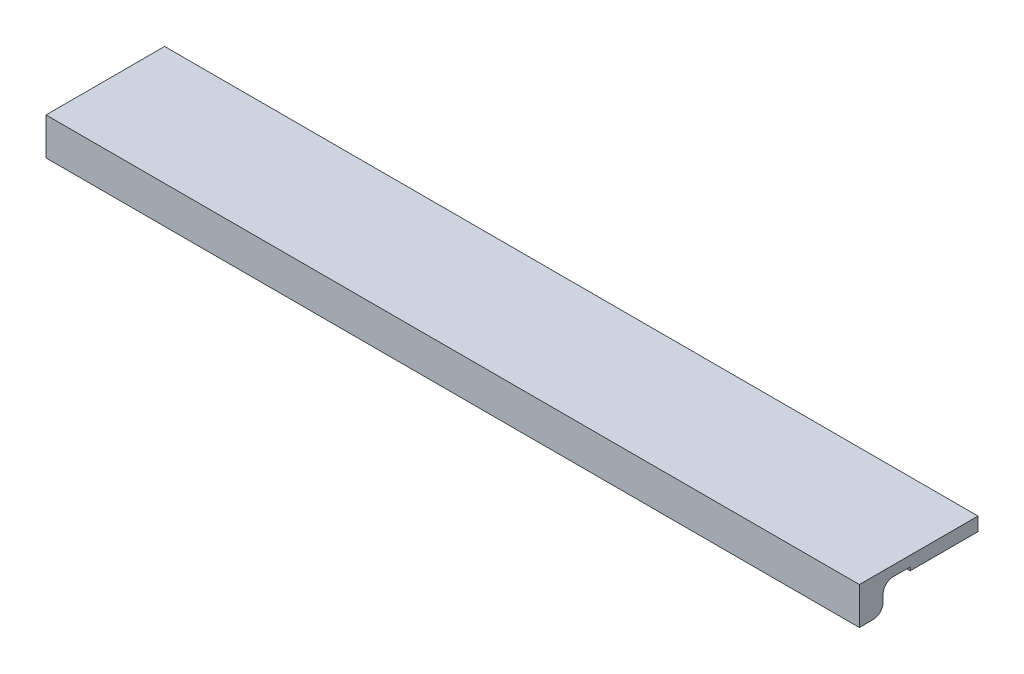
ISO-10303-21;
HEADER;
FILE_DESCRIPTION(('STEP AP214'),'2;1');
FILE_NAME('part.step','',(''),(''),'','','');
FILE_SCHEMA(('AUTOMOTIVE_DESIGN { 1 0 10303 214 1 1 1 1 }'));
ENDSEC;
DATA;
#1=APPLICATION_CONTEXT('core data for automotive mechanical design processes');
#2=APPLICATION_PROTOCOL_DEFINITION('international standard','automotive_design',2000,#1);
#3=PRODUCT_CONTEXT('',#1,'mechanical');
#4=PRODUCT('Part','Part','',(#3));
#5=PRODUCT_RELATED_PRODUCT_CATEGORY('part','',(#4));
#6=PRODUCT_DEFINITION_FORMATION('','',#4);
#7=PRODUCT_DEFINITION_CONTEXT('part definition',#1,'design');
#8=PRODUCT_DEFINITION('design','',#6,#7);
#9=PRODUCT_DEFINITION_SHAPE('','',#8);
#10=(LENGTH_UNIT() NAMED_UNIT(*) SI_UNIT(.MILLI.,.METRE.));
#11=(NAMED_UNIT(*) PLANE_ANGLE_UNIT() SI_UNIT($,.RADIAN.));
#12=(NAMED_UNIT(*) SI_UNIT($,.STERADIAN.) SOLID_ANGLE_UNIT());
#13=UNCERTAINTY_MEASURE_WITH_UNIT(LENGTH_MEASURE(1.E-05),#10,'distance_accuracy_value','');
#14=(GEOMETRIC_REPRESENTATION_CONTEXT(3) GLOBAL_UNCERTAINTY_ASSIGNED_CONTEXT((#13)) GLOBAL_UNIT_ASSIGNED_CONTEXT((#10,
#11,#12)) REPRESENTATION_CONTEXT('',''));
#15=CARTESIAN_POINT('',(0.,0.,0.));
#16=DIRECTION('',(0.,0.,1.));
#17=DIRECTION('',(1.,0.,0.));
#18=AXIS2_PLACEMENT_3D('',#15,#16,#17);
#19=CARTESIAN_POINT('',(0.,0.,0.));
#20=DIRECTION('',(0.,1.,0.));
#21=DIRECTION('',(0.,0.,1.));
#22=AXIS2_PLACEMENT_3D('',#19,#20,#21);
#23=PLANE('',#22);
#24=DIRECTION('',(1.,0.,0.));
#25=VECTOR('',#24,1.);
#26=CARTESIAN_POINT('',(120.,0.,2.5));
#27=LINE('',#26,#25);
#28=CARTESIAN_POINT('',(-120.,0.,2.50000000000001));
#29=VERTEX_POINT('',#28);
#30=CARTESIAN_POINT('',(120.,0.,2.5));
#31=VERTEX_POINT('',#30);
#32=EDGE_CURVE('E123',#29,#31,#27,.T.);
#33=ORIENTED_EDGE('',*,*,#32,.T.);
#34=DIRECTION('',(0.,0.,-1.));
#35=VECTOR('',#34,1.);
#36=CARTESIAN_POINT('',(120.,0.,-17.5));
#37=LINE('',#36,#35);
#38=CARTESIAN_POINT('',(120.,0.,7.5));
#39=VERTEX_POINT('',#38);
#40=EDGE_CURVE('E133',#39,#31,#37,.T.);
#41=ORIENTED_EDGE('',*,*,#40,.F.);
#42=DIRECTION('',(1.,0.,0.));
#43=VECTOR('',#42,1.);
#44=CARTESIAN_POINT('',(-120.,0.,7.5));
#45=LINE('',#44,#43);
#46=CARTESIAN_POINT('',(-120.,0.,7.5));
#47=VERTEX_POINT('',#46);
#48=EDGE_CURVE('E167',#39,#47,#45,.F.);
#49=ORIENTED_EDGE('',*,*,#48,.T.);
#50=DIRECTION('',(0.,0.,1.));
#51=VECTOR('',#50,1.);
#52=CARTESIAN_POINT('',(-120.,0.,-17.5));
#53=LINE('',#52,#51);
#54=EDGE_CURVE('E135',#29,#47,#53,.T.);
#55=ORIENTED_EDGE('',*,*,#54,.F.);
#56=EDGE_LOOP('',(#33,#41,#49,#55));
#57=FACE_BOUND('',#56,.T.);
#58=ADVANCED_FACE('F32',(#57),#23,.F.);
#59=CARTESIAN_POINT('',(120.,3.,-17.5));
#60=DIRECTION('',(-1.,0.,0.));
#61=DIRECTION('',(0.,0.,1.));
#62=AXIS2_PLACEMENT_3D('',#59,#60,#61);
#63=PLANE('',#62);
#64=DIRECTION('',(0.,-1.,0.));
#65=VECTOR('',#64,1.);
#66=CARTESIAN_POINT('',(120.,-7.,2.5));
#67=LINE('',#66,#65);
#68=CARTESIAN_POINT('',(120.,-0.999999999999952,2.5));
#69=VERTEX_POINT('',#68);
#70=EDGE_CURVE('E120',#31,#69,#67,.T.);
#71=ORIENTED_EDGE('',*,*,#70,.T.);
#72=DIRECTION('',(0.,0.,-1.));
#73=VECTOR('',#72,1.);
#74=CARTESIAN_POINT('',(120.,-0.999999999999952,-17.5));
#75=LINE('',#74,#73);
#76=CARTESIAN_POINT('',(120.,-0.999999999999952,-17.5));
#77=VERTEX_POINT('',#76);
#78=EDGE_CURVE('E11',#69,#77,#75,.T.);
#79=ORIENTED_EDGE('',*,*,#78,.T.);
#80=DIRECTION('',(0.,-1.,0.));
#81=VECTOR('',#80,1.);
#82=CARTESIAN_POINT('',(120.,3.,-17.5));
#83=LINE('',#82,#81);
#84=CARTESIAN_POINT('',(120.,3.,-17.5));
#85=VERTEX_POINT('',#84);
#86=EDGE_CURVE('E159',#85,#77,#83,.T.);
#87=ORIENTED_EDGE('',*,*,#86,.F.);
#88=DIRECTION('',(0.,0.,-1.));
#89=VECTOR('',#88,1.);
#90=CARTESIAN_POINT('',(120.,3.,-17.5));
#91=LINE('',#90,#89);
#92=CARTESIAN_POINT('',(120.,3.,17.5));
#93=VERTEX_POINT('',#92);
#94=EDGE_CURVE('E143',#93,#85,#91,.T.);
#95=ORIENTED_EDGE('',*,*,#94,.F.);
#96=DIRECTION('',(0.,-1.,0.));
#97=VECTOR('',#96,1.);
#98=CARTESIAN_POINT('',(120.,3.,17.5));
#99=LINE('',#98,#97);
#100=CARTESIAN_POINT('',(120.,-8.,17.5));
#101=VERTEX_POINT('',#100);
#102=EDGE_CURVE('E152',#93,#101,#99,.T.);
#103=ORIENTED_EDGE('',*,*,#102,.T.);
#104=DIRECTION('',(0.,0.,1.));
#105=VECTOR('',#104,1.);
#106=CARTESIAN_POINT('',(120.,-8.,17.5));
#107=LINE('',#106,#105);
#108=CARTESIAN_POINT('',(120.,-8.,13.5));
#109=VERTEX_POINT('',#108);
#110=EDGE_CURVE('E128',#109,#101,#107,.T.);
#111=ORIENTED_EDGE('',*,*,#110,.F.);
#112=CARTESIAN_POINT('',(120.,-5.,13.5));
#113=DIRECTION('',(-1.,0.,0.));
#114=DIRECTION('',(0.,0.,1.));
#115=AXIS2_PLACEMENT_3D('',#112,#113,#114);
#116=CIRCLE('',#115,3.);
#117=CARTESIAN_POINT('',(120.,-5.,10.5));
#118=VERTEX_POINT('',#117);
#119=EDGE_CURVE('E172',#109,#118,#116,.F.);
#120=ORIENTED_EDGE('',*,*,#119,.T.);
#121=DIRECTION('',(0.,1.,0.));
#122=VECTOR('',#121,1.);
#123=CARTESIAN_POINT('',(120.,-8.,10.5));
#124=LINE('',#123,#122);
#125=CARTESIAN_POINT('',(120.,-3.,10.5));
#126=VERTEX_POINT('',#125);
#127=EDGE_CURVE('E146',#118,#126,#124,.T.);
#128=ORIENTED_EDGE('',*,*,#127,.T.);
#129=CARTESIAN_POINT('',(120.,-3.,7.5));
#130=DIRECTION('',(-1.,0.,0.));
#131=DIRECTION('',(0.,0.,1.));
#132=AXIS2_PLACEMENT_3D('',#129,#130,#131);
#133=CIRCLE('',#132,3.);
#134=EDGE_CURVE('E140',#126,#39,#133,.T.);
#135=ORIENTED_EDGE('',*,*,#134,.T.);
#136=ORIENTED_EDGE('',*,*,#40,.T.);
#137=EDGE_LOOP('',(#71,#79,#87,#95,#103,#111,#120,#128,#135,#136));
#138=FACE_BOUND('',#137,.T.);
#139=ADVANCED_FACE('F138',(#138),#63,.F.);
#140=CARTESIAN_POINT('',(-120.,3.,-17.5));
#141=DIRECTION('',(0.,0.,1.));
#142=DIRECTION('',(1.,0.,0.));
#143=AXIS2_PLACEMENT_3D('',#140,#141,#142);
#144=PLANE('',#143);
#145=DIRECTION('',(-1.,0.,0.));
#146=VECTOR('',#145,1.);
#147=CARTESIAN_POINT('',(120.,-7.,-17.5));
#148=LINE('',#147,#146);
#149=CARTESIAN_POINT('',(110.,-7.,-17.5));
#150=VERTEX_POINT('',#149);
#151=CARTESIAN_POINT('',(-110.,-6.99999999999999,-17.5));
#152=VERTEX_POINT('',#151);
#153=EDGE_CURVE('E197',#150,#152,#148,.T.);
#154=ORIENTED_EDGE('',*,*,#153,.T.);
#155=DIRECTION('',(-0.857492925712545,0.514495755427526,0.));
#156=VECTOR('',#155,1.);
#157=CARTESIAN_POINT('',(-110.,-6.99999999999998,-17.5));
#158=LINE('',#157,#156);
#159=CARTESIAN_POINT('',(-120.,-0.99999999999994,-17.5));
#160=VERTEX_POINT('',#159);
#161=EDGE_CURVE('E188',#152,#160,#158,.T.);
#162=ORIENTED_EDGE('',*,*,#161,.T.);
#163=DIRECTION('',(0.,-1.,0.));
#164=VECTOR('',#163,1.);
#165=CARTESIAN_POINT('',(-120.,3.,-17.5));
#166=LINE('',#165,#164);
#167=CARTESIAN_POINT('',(-120.,3.,-17.5));
#168=VERTEX_POINT('',#167);
#169=EDGE_CURVE('E157',#168,#160,#166,.T.);
#170=ORIENTED_EDGE('',*,*,#169,.F.);
#171=DIRECTION('',(-1.,0.,0.));
#172=VECTOR('',#171,1.);
#173=CARTESIAN_POINT('',(-120.,3.,-17.5));
#174=LINE('',#173,#172);
#175=EDGE_CURVE('E217',#85,#168,#174,.T.);
#176=ORIENTED_EDGE('',*,*,#175,.F.);
#177=ORIENTED_EDGE('',*,*,#86,.T.);
#178=DIRECTION('',(-0.857492925712545,-0.514495755427526,0.));
#179=VECTOR('',#178,1.);
#180=CARTESIAN_POINT('',(120.,-0.999999999999952,-17.5));
#181=LINE('',#180,#179);
#182=EDGE_CURVE('E186',#77,#150,#181,.T.);
#183=ORIENTED_EDGE('',*,*,#182,.T.);
#184=EDGE_LOOP('',(#154,#162,#170,#176,#177,#183));
#185=FACE_BOUND('',#184,.T.);
#186=ADVANCED_FACE('F232',(#185),#144,.F.);
#187=CARTESIAN_POINT('',(-120.,3.,-17.5));
#188=DIRECTION('',(1.,0.,0.));
#189=DIRECTION('',(0.,0.,-1.));
#190=AXIS2_PLACEMENT_3D('',#187,#188,#189);
#191=PLANE('',#190);
#192=ORIENTED_EDGE('',*,*,#169,.T.);
#193=DIRECTION('',(0.,0.,1.));
#194=VECTOR('',#193,1.);
#195=CARTESIAN_POINT('',(-120.,-0.99999999999994,2.50000000000001));
#196=LINE('',#195,#194);
#197=CARTESIAN_POINT('',(-120.,-0.999999999999947,2.50000000000001));
#198=VERTEX_POINT('',#197);
#199=EDGE_CURVE('E56',#160,#198,#196,.T.);
#200=ORIENTED_EDGE('',*,*,#199,.T.);
#201=DIRECTION('',(0.,1.,0.));
#202=VECTOR('',#201,1.);
#203=CARTESIAN_POINT('',(-120.,-6.99999999999999,2.50000000000001));
#204=LINE('',#203,#202);
#205=EDGE_CURVE('E136',#198,#29,#204,.T.);
#206=ORIENTED_EDGE('',*,*,#205,.T.);
#207=ORIENTED_EDGE('',*,*,#54,.T.);
#208=CARTESIAN_POINT('',(-120.,-3.,7.5));
#209=DIRECTION('',(1.,0.,0.));
#210=DIRECTION('',(0.,0.,-1.));
#211=AXIS2_PLACEMENT_3D('',#208,#209,#210);
#212=CIRCLE('',#211,3.);
#213=CARTESIAN_POINT('',(-120.,-3.,10.5));
#214=VERTEX_POINT('',#213);
#215=EDGE_CURVE('E177',#47,#214,#212,.T.);
#216=ORIENTED_EDGE('',*,*,#215,.T.);
#217=DIRECTION('',(0.,1.,0.));
#218=VECTOR('',#217,1.);
#219=CARTESIAN_POINT('',(-120.,-8.,10.5));
#220=LINE('',#219,#218);
#221=CARTESIAN_POINT('',(-120.,-5.,10.5));
#222=VERTEX_POINT('',#221);
#223=EDGE_CURVE('E141',#222,#214,#220,.T.);
#224=ORIENTED_EDGE('',*,*,#223,.F.);
#225=CARTESIAN_POINT('',(-120.,-5.,13.5));
#226=DIRECTION('',(1.,0.,0.));
#227=DIRECTION('',(0.,0.,-1.));
#228=AXIS2_PLACEMENT_3D('',#225,#226,#227);
#229=CIRCLE('',#228,3.);
#230=CARTESIAN_POINT('',(-120.,-8.,13.5));
#231=VERTEX_POINT('',#230);
#232=EDGE_CURVE('E174',#222,#231,#229,.F.);
#233=ORIENTED_EDGE('',*,*,#232,.T.);
#234=DIRECTION('',(0.,0.,-1.));
#235=VECTOR('',#234,1.);
#236=CARTESIAN_POINT('',(-120.,-8.,17.5));
#237=LINE('',#236,#235);
#238=CARTESIAN_POINT('',(-120.,-8.,17.5));
#239=VERTEX_POINT('',#238);
#240=EDGE_CURVE('E211',#239,#231,#237,.T.);
#241=ORIENTED_EDGE('',*,*,#240,.F.);
#242=DIRECTION('',(0.,-1.,0.));
#243=VECTOR('',#242,1.);
#244=CARTESIAN_POINT('',(-120.,3.,17.5));
#245=LINE('',#244,#243);
#246=CARTESIAN_POINT('',(-120.,3.,17.5));
#247=VERTEX_POINT('',#246);
#248=EDGE_CURVE('E155',#247,#239,#245,.T.);
#249=ORIENTED_EDGE('',*,*,#248,.F.);
#250=DIRECTION('',(0.,0.,1.));
#251=VECTOR('',#250,1.);
#252=CARTESIAN_POINT('',(-120.,3.,-17.5));
#253=LINE('',#252,#251);
#254=EDGE_CURVE('E218',#168,#247,#253,.T.);
#255=ORIENTED_EDGE('',*,*,#254,.F.);
#256=EDGE_LOOP('',(#192,#200,#206,#207,#216,#224,#233,#241,#249,#255));
#257=FACE_BOUND('',#256,.T.);
#258=ADVANCED_FACE('F239',(#257),#191,.F.);
#259=CARTESIAN_POINT('',(-120.,3.,17.5));
#260=DIRECTION('',(0.,0.,-1.));
#261=DIRECTION('',(-1.,0.,0.));
#262=AXIS2_PLACEMENT_3D('',#259,#260,#261);
#263=PLANE('',#262);
#264=ORIENTED_EDGE('',*,*,#248,.T.);
#265=DIRECTION('',(-1.,0.,0.));
#266=VECTOR('',#265,1.);
#267=CARTESIAN_POINT('',(120.,-8.,17.5));
#268=LINE('',#267,#266);
#269=EDGE_CURVE('E208',#101,#239,#268,.T.);
#270=ORIENTED_EDGE('',*,*,#269,.F.);
#271=ORIENTED_EDGE('',*,*,#102,.F.);
#272=DIRECTION('',(1.,0.,0.));
#273=VECTOR('',#272,1.);
#274=CARTESIAN_POINT('',(-120.,3.,17.5));
#275=LINE('',#274,#273);
#276=EDGE_CURVE('E149',#247,#93,#275,.T.);
#277=ORIENTED_EDGE('',*,*,#276,.F.);
#278=EDGE_LOOP('',(#264,#270,#271,#277));
#279=FACE_BOUND('',#278,.T.);
#280=ADVANCED_FACE('F229',(#279),#263,.F.);
#281=CARTESIAN_POINT('',(0.,3.,0.));
#282=DIRECTION('',(0.,1.,0.));
#283=DIRECTION('',(0.,0.,1.));
#284=AXIS2_PLACEMENT_3D('',#281,#282,#283);
#285=PLANE('',#284);
#286=ORIENTED_EDGE('',*,*,#94,.T.);
#287=ORIENTED_EDGE('',*,*,#175,.T.);
#288=ORIENTED_EDGE('',*,*,#254,.T.);
#289=ORIENTED_EDGE('',*,*,#276,.T.);
#290=EDGE_LOOP('',(#286,#287,#288,#289));
#291=FACE_BOUND('',#290,.T.);
#292=ADVANCED_FACE('F224',(#291),#285,.T.);
#293=CARTESIAN_POINT('',(120.,-8.,10.5));
#294=DIRECTION('',(0.,0.,1.));
#295=DIRECTION('',(1.,0.,0.));
#296=AXIS2_PLACEMENT_3D('',#293,#294,#295);
#297=PLANE('',#296);
#298=ORIENTED_EDGE('',*,*,#223,.T.);
#299=DIRECTION('',(1.,0.,0.));
#300=VECTOR('',#299,1.);
#301=CARTESIAN_POINT('',(120.,-3.,10.5));
#302=LINE('',#301,#300);
#303=EDGE_CURVE('E164',#214,#126,#302,.T.);
#304=ORIENTED_EDGE('',*,*,#303,.T.);
#305=ORIENTED_EDGE('',*,*,#127,.F.);
#306=DIRECTION('',(1.,0.,0.));
#307=VECTOR('',#306,1.);
#308=CARTESIAN_POINT('',(120.,-5.,10.5));
#309=LINE('',#308,#307);
#310=EDGE_CURVE('E162',#118,#222,#309,.F.);
#311=ORIENTED_EDGE('',*,*,#310,.T.);
#312=EDGE_LOOP('',(#298,#304,#305,#311));
#313=FACE_BOUND('',#312,.T.);
#314=ADVANCED_FACE('F248',(#313),#297,.F.);
#315=CARTESIAN_POINT('',(0.,-8.,0.));
#316=DIRECTION('',(0.,1.,0.));
#317=DIRECTION('',(0.,0.,1.));
#318=AXIS2_PLACEMENT_3D('',#315,#316,#317);
#319=PLANE('',#318);
#320=ORIENTED_EDGE('',*,*,#240,.T.);
#321=DIRECTION('',(1.,0.,0.));
#322=VECTOR('',#321,1.);
#323=CARTESIAN_POINT('',(0.,-8.,13.5));
#324=LINE('',#323,#322);
#325=EDGE_CURVE('E169',#231,#109,#324,.T.);
#326=ORIENTED_EDGE('',*,*,#325,.T.);
#327=ORIENTED_EDGE('',*,*,#110,.T.);
#328=ORIENTED_EDGE('',*,*,#269,.T.);
#329=EDGE_LOOP('',(#320,#326,#327,#328));
#330=FACE_BOUND('',#329,.T.);
#331=ADVANCED_FACE('F242',(#330),#319,.F.);
#332=CARTESIAN_POINT('',(120.,-3.,7.5));
#333=DIRECTION('',(-1.,0.,0.));
#334=DIRECTION('',(0.,0.,1.));
#335=AXIS2_PLACEMENT_3D('',#332,#333,#334);
#336=CYLINDRICAL_SURFACE('',#335,3.);
#337=ORIENTED_EDGE('',*,*,#215,.F.);
#338=ORIENTED_EDGE('',*,*,#48,.F.);
#339=ORIENTED_EDGE('',*,*,#134,.F.);
#340=ORIENTED_EDGE('',*,*,#303,.F.);
#341=EDGE_LOOP('',(#337,#338,#339,#340));
#342=FACE_BOUND('',#341,.T.);
#343=ADVANCED_FACE('F255',(#342),#336,.F.);
#344=CARTESIAN_POINT('',(0.,-5.,13.5));
#345=DIRECTION('',(1.,0.,0.));
#346=DIRECTION('',(0.,0.,-1.));
#347=AXIS2_PLACEMENT_3D('',#344,#345,#346);
#348=CYLINDRICAL_SURFACE('',#347,3.);
#349=ORIENTED_EDGE('',*,*,#232,.F.);
#350=ORIENTED_EDGE('',*,*,#310,.F.);
#351=ORIENTED_EDGE('',*,*,#119,.F.);
#352=ORIENTED_EDGE('',*,*,#325,.F.);
#353=EDGE_LOOP('',(#349,#350,#351,#352));
#354=FACE_BOUND('',#353,.T.);
#355=ADVANCED_FACE('F252',(#354),#348,.T.);
#356=CARTESIAN_POINT('',(120.,-7.,2.5));
#357=DIRECTION('',(0.,-1.,0.));
#358=DIRECTION('',(1.,0.,0.));
#359=AXIS2_PLACEMENT_3D('',#356,#357,#358);
#360=PLANE('',#359);
#361=DIRECTION('',(-1.,0.,0.));
#362=VECTOR('',#361,1.);
#363=CARTESIAN_POINT('',(-120.,-6.99999999999999,-7.50000000000008));
#364=LINE('',#363,#362);
#365=CARTESIAN_POINT('',(110.,-7.,-7.50000000000009));
#366=VERTEX_POINT('',#365);
#367=CARTESIAN_POINT('',(-110.,-6.99999999999999,-7.50000000000008));
#368=VERTEX_POINT('',#367);
#369=EDGE_CURVE('E181',#366,#368,#364,.T.);
#370=ORIENTED_EDGE('',*,*,#369,.T.);
#371=DIRECTION('',(0.,0.,-1.));
#372=VECTOR('',#371,1.);
#373=CARTESIAN_POINT('',(-110.,-6.99999999999999,-17.5));
#374=LINE('',#373,#372);
#375=EDGE_CURVE('E183',#368,#152,#374,.T.);
#376=ORIENTED_EDGE('',*,*,#375,.T.);
#377=ORIENTED_EDGE('',*,*,#153,.F.);
#378=DIRECTION('',(0.,0.,1.));
#379=VECTOR('',#378,1.);
#380=CARTESIAN_POINT('',(110.,-7.,2.5));
#381=LINE('',#380,#379);
#382=EDGE_CURVE('E179',#150,#366,#381,.T.);
#383=ORIENTED_EDGE('',*,*,#382,.T.);
#384=EDGE_LOOP('',(#370,#376,#377,#383));
#385=FACE_BOUND('',#384,.T.);
#386=ADVANCED_FACE('F237',(#385),#360,.T.);
#387=CARTESIAN_POINT('',(0.,0.,2.50000000000001));
#388=DIRECTION('',(0.,0.,-1.));
#389=DIRECTION('',(-1.,0.,0.));
#390=AXIS2_PLACEMENT_3D('',#387,#388,#389);
#391=PLANE('',#390);
#392=ORIENTED_EDGE('',*,*,#205,.F.);
#393=DIRECTION('',(1.,0.,0.));
#394=VECTOR('',#393,1.);
#395=CARTESIAN_POINT('',(120.,-0.999999999999953,2.5));
#396=LINE('',#395,#394);
#397=EDGE_CURVE('E41',#198,#69,#396,.T.);
#398=ORIENTED_EDGE('',*,*,#397,.T.);
#399=ORIENTED_EDGE('',*,*,#70,.F.);
#400=ORIENTED_EDGE('',*,*,#32,.F.);
#401=EDGE_LOOP('',(#392,#398,#399,#400));
#402=FACE_BOUND('',#401,.T.);
#403=ADVANCED_FACE('F122',(#402),#391,.F.);
#404=CARTESIAN_POINT('',(120.,-0.999999999999952,-17.5));
#405=DIRECTION('',(0.514495755427526,-0.857492925712545,0.));
#406=DIRECTION('',(0.,0.,1.));
#407=AXIS2_PLACEMENT_3D('',#404,#405,#406);
#408=PLANE('',#407);
#409=ORIENTED_EDGE('',*,*,#182,.F.);
#410=ORIENTED_EDGE('',*,*,#78,.F.);
#411=DIRECTION('',(-0.65094455490412,-0.390566732942471,-0.65094455490412));
#412=VECTOR('',#411,1.);
#413=CARTESIAN_POINT('',(111.525423728814,-6.08474576271181,-5.97457627118644));
#414=LINE('',#413,#412);
#415=EDGE_CURVE('E36',#366,#69,#414,.F.);
#416=ORIENTED_EDGE('',*,*,#415,.F.);
#417=ORIENTED_EDGE('',*,*,#382,.F.);
#418=EDGE_LOOP('',(#409,#410,#416,#417));
#419=FACE_BOUND('',#418,.T.);
#420=ADVANCED_FACE('F34',(#419),#408,.T.);
#421=CARTESIAN_POINT('',(120.,-7.,-7.50000000000009));
#422=DIRECTION('',(0.,-0.857492925712545,0.514495755427526));
#423=DIRECTION('',(1.,0.,0.));
#424=AXIS2_PLACEMENT_3D('',#421,#422,#423);
#425=PLANE('',#424);
#426=ORIENTED_EDGE('',*,*,#415,.T.);
#427=ORIENTED_EDGE('',*,*,#397,.F.);
#428=DIRECTION('',(0.650944554904119,-0.390566732942471,-0.650944554904119));
#429=VECTOR('',#428,1.);
#430=CARTESIAN_POINT('',(-12.5423728813558,-65.4745762711864,-104.957627118644));
#431=LINE('',#430,#429);
#432=EDGE_CURVE('E191',#368,#198,#431,.F.);
#433=ORIENTED_EDGE('',*,*,#432,.F.);
#434=ORIENTED_EDGE('',*,*,#369,.F.);
#435=EDGE_LOOP('',(#426,#427,#433,#434));
#436=FACE_BOUND('',#435,.T.);
#437=ADVANCED_FACE('F361',(#436),#425,.T.);
#438=CARTESIAN_POINT('',(-110.,-6.99999999999999,2.49999999999991));
#439=DIRECTION('',(-0.514495755427526,-0.857492925712544,0.));
#440=DIRECTION('',(0.,0.,1.));
#441=AXIS2_PLACEMENT_3D('',#438,#439,#440);
#442=PLANE('',#441);
#443=ORIENTED_EDGE('',*,*,#432,.T.);
#444=ORIENTED_EDGE('',*,*,#199,.F.);
#445=ORIENTED_EDGE('',*,*,#161,.F.);
#446=ORIENTED_EDGE('',*,*,#375,.F.);
#447=EDGE_LOOP('',(#443,#444,#445,#446));
#448=FACE_BOUND('',#447,.T.);
#449=ADVANCED_FACE('F238',(#448),#442,.T.);
#450=CLOSED_SHELL('',(#58,#139,#186,#258,#280,#292,#314,#331,#343,#355,#386,#403,#420,#437,#449));
#451=MANIFOLD_SOLID_BREP('B2',#450);
#452=ADVANCED_BREP_SHAPE_REPRESENTATION('',(#18,#451),#14);
#453=SHAPE_DEFINITION_REPRESENTATION(#9,#452);
ENDSEC;
END-ISO-10303-21;
